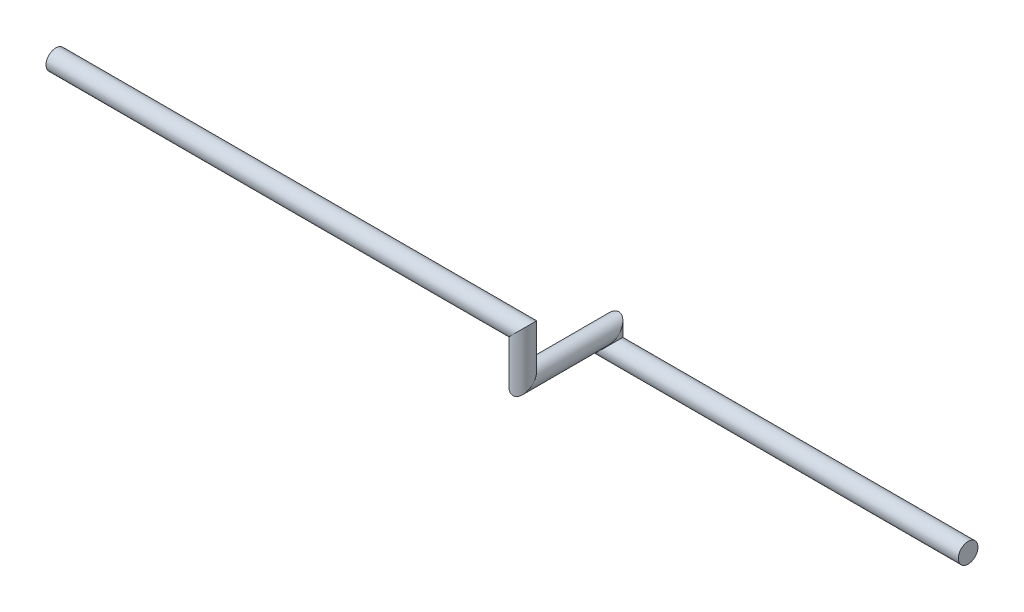
ISO-10303-21;
HEADER;
FILE_DESCRIPTION(('STEP AP214'),'2;1');
FILE_NAME('part.step','',(''),(''),'','','');
FILE_SCHEMA(('AUTOMOTIVE_DESIGN { 1 0 10303 214 1 1 1 1 }'));
ENDSEC;
DATA;
#1=APPLICATION_CONTEXT('core data for automotive mechanical design processes');
#2=APPLICATION_PROTOCOL_DEFINITION('international standard','automotive_design',2000,#1);
#3=PRODUCT_CONTEXT('',#1,'mechanical');
#4=PRODUCT('Part','Part','',(#3));
#5=PRODUCT_RELATED_PRODUCT_CATEGORY('part','',(#4));
#6=PRODUCT_DEFINITION_FORMATION('','',#4);
#7=PRODUCT_DEFINITION_CONTEXT('part definition',#1,'design');
#8=PRODUCT_DEFINITION('design','',#6,#7);
#9=PRODUCT_DEFINITION_SHAPE('','',#8);
#10=(LENGTH_UNIT() NAMED_UNIT(*) SI_UNIT(.MILLI.,.METRE.));
#11=(NAMED_UNIT(*) PLANE_ANGLE_UNIT() SI_UNIT($,.RADIAN.));
#12=(NAMED_UNIT(*) SI_UNIT($,.STERADIAN.) SOLID_ANGLE_UNIT());
#13=UNCERTAINTY_MEASURE_WITH_UNIT(LENGTH_MEASURE(1.E-05),#10,'distance_accuracy_value','');
#14=(GEOMETRIC_REPRESENTATION_CONTEXT(3) GLOBAL_UNCERTAINTY_ASSIGNED_CONTEXT((#13)) GLOBAL_UNIT_ASSIGNED_CONTEXT((#10,
#11,#12)) REPRESENTATION_CONTEXT('',''));
#15=CARTESIAN_POINT('',(0.,0.,0.));
#16=DIRECTION('',(0.,0.,1.));
#17=DIRECTION('',(1.,0.,0.));
#18=AXIS2_PLACEMENT_3D('',#15,#16,#17);
#19=CARTESIAN_POINT('',(-1150.,80.,120.));
#20=DIRECTION('',(1.,0.,0.));
#21=DIRECTION('',(0.,0.,-1.));
#22=AXIS2_PLACEMENT_3D('',#19,#20,#21);
#23=PLANE('',#22);
#24=CARTESIAN_POINT('',(-1150.,80.,120.));
#25=DIRECTION('',(1.,0.,0.));
#26=DIRECTION('',(0.,0.,-1.));
#27=AXIS2_PLACEMENT_3D('',#24,#25,#26);
#28=CIRCLE('',#27,13.7);
#29=CARTESIAN_POINT('',(-1150.,80.,106.3));
#30=VERTEX_POINT('',#29);
#31=EDGE_CURVE('E38',#30,#30,#28,.T.);
#32=ORIENTED_EDGE('',*,*,#31,.F.);
#33=EDGE_LOOP('',(#32));
#34=FACE_BOUND('',#33,.T.);
#35=ADVANCED_FACE('F35',(#34),#23,.F.);
#36=CARTESIAN_POINT('',(0.,0.,0.));
#37=DIRECTION('',(1.,0.,0.));
#38=DIRECTION('',(0.,0.,-1.));
#39=AXIS2_PLACEMENT_3D('',#36,#37,#38);
#40=PLANE('',#39);
#41=CARTESIAN_POINT('',(0.,0.,0.));
#42=DIRECTION('',(1.,0.,0.));
#43=DIRECTION('',(0.,0.,-1.));
#44=AXIS2_PLACEMENT_3D('',#41,#42,#43);
#45=CIRCLE('',#44,13.7);
#46=CARTESIAN_POINT('',(0.,0.,-13.7));
#47=VERTEX_POINT('',#46);
#48=EDGE_CURVE('E43',#47,#47,#45,.T.);
#49=ORIENTED_EDGE('',*,*,#48,.T.);
#50=EDGE_LOOP('',(#49));
#51=FACE_BOUND('',#50,.T.);
#52=ADVANCED_FACE('F86',(#51),#40,.T.);
#53=CARTESIAN_POINT('',(-469.76,80.,120.));
#54=DIRECTION('',(-1.,0.,0.));
#55=DIRECTION('',(0.,0.,1.));
#56=AXIS2_PLACEMENT_3D('',#53,#54,#55);
#57=CYLINDRICAL_SURFACE('',#56,13.7);
#58=CARTESIAN_POINT('',(-500.,80.,120.));
#59=DIRECTION('',(-0.707106781186548,0.707106781186548,0.));
#60=DIRECTION('',(0.707106781186548,0.707106781186548,0.));
#61=AXIS2_PLACEMENT_3D('',#58,#59,#60);
#62=ELLIPSE('',#61,19.3747258045114,13.7);
#63=CARTESIAN_POINT('',(-486.3,93.7,120.));
#64=VERTEX_POINT('',#63);
#65=EDGE_CURVE('E53',#64,#64,#62,.T.);
#66=ORIENTED_EDGE('',*,*,#65,.T.);
#67=EDGE_LOOP('',(#66));
#68=FACE_BOUND('',#67,.T.);
#69=ORIENTED_EDGE('',*,*,#31,.T.);
#70=EDGE_LOOP('',(#69));
#71=FACE_BOUND('',#70,.T.);
#72=ADVANCED_FACE('F83',(#68,#71),#57,.T.);
#73=CARTESIAN_POINT('',(-500.,4.83000000000001,120.));
#74=DIRECTION('',(0.,1.,0.));
#75=DIRECTION('',(0.,0.,1.));
#76=AXIS2_PLACEMENT_3D('',#73,#74,#75);
#77=CYLINDRICAL_SURFACE('',#76,13.7);
#78=CARTESIAN_POINT('',(-500.,20.,120.));
#79=DIRECTION('',(0.,0.707106781186547,0.707106781186547));
#80=DIRECTION('',(0.,-0.707106781186548,0.707106781186548));
#81=AXIS2_PLACEMENT_3D('',#78,#79,#80);
#82=ELLIPSE('',#81,19.3747258045114,13.7);
#83=CARTESIAN_POINT('',(-500.,6.29999999999999,133.7));
#84=VERTEX_POINT('',#83);
#85=EDGE_CURVE('E76',#84,#84,#82,.T.);
#86=ORIENTED_EDGE('',*,*,#85,.T.);
#87=EDGE_LOOP('',(#86));
#88=FACE_BOUND('',#87,.T.);
#89=ORIENTED_EDGE('',*,*,#65,.F.);
#90=EDGE_LOOP('',(#89));
#91=FACE_BOUND('',#90,.T.);
#92=ADVANCED_FACE('F85',(#88,#91),#77,.T.);
#93=CARTESIAN_POINT('',(-500.,20.,-15.17));
#94=DIRECTION('',(0.,0.,1.));
#95=DIRECTION('',(1.,0.,0.));
#96=AXIS2_PLACEMENT_3D('',#93,#94,#95);
#97=CYLINDRICAL_SURFACE('',#96,13.7);
#98=CARTESIAN_POINT('',(-500.,20.,0.));
#99=DIRECTION('',(0.,0.707106781186547,0.707106781186547));
#100=DIRECTION('',(0.,0.707106781186548,-0.707106781186548));
#101=AXIS2_PLACEMENT_3D('',#98,#99,#100);
#102=ELLIPSE('',#101,19.3747258045114,13.7);
#103=CARTESIAN_POINT('',(-500.,33.7,-13.7));
#104=VERTEX_POINT('',#103);
#105=EDGE_CURVE('E74',#104,#104,#102,.T.);
#106=ORIENTED_EDGE('',*,*,#105,.T.);
#107=EDGE_LOOP('',(#106));
#108=FACE_BOUND('',#107,.T.);
#109=ORIENTED_EDGE('',*,*,#85,.F.);
#110=EDGE_LOOP('',(#109));
#111=FACE_BOUND('',#110,.T.);
#112=ADVANCED_FACE('F71',(#108,#111),#97,.T.);
#113=CARTESIAN_POINT('',(-500.,-30.24,0.));
#114=DIRECTION('',(0.,1.,0.));
#115=DIRECTION('',(0.,0.,1.));
#116=AXIS2_PLACEMENT_3D('',#113,#114,#115);
#117=CYLINDRICAL_SURFACE('',#116,13.7);
#118=CARTESIAN_POINT('',(-500.,0.,0.));
#119=DIRECTION('',(-0.707106781186547,0.707106781186547,0.));
#120=DIRECTION('',(-0.707106781186548,-0.707106781186548,0.));
#121=AXIS2_PLACEMENT_3D('',#118,#119,#120);
#122=ELLIPSE('',#121,19.3747258045114,13.7);
#123=CARTESIAN_POINT('',(-513.7,-13.7,0.));
#124=VERTEX_POINT('',#123);
#125=EDGE_CURVE('E11',#124,#124,#122,.T.);
#126=ORIENTED_EDGE('',*,*,#125,.T.);
#127=EDGE_LOOP('',(#126));
#128=FACE_BOUND('',#127,.T.);
#129=ORIENTED_EDGE('',*,*,#105,.F.);
#130=EDGE_LOOP('',(#129));
#131=FACE_BOUND('',#130,.T.);
#132=ADVANCED_FACE('F68',(#128,#131),#117,.T.);
#133=CARTESIAN_POINT('',(0.,0.,0.));
#134=DIRECTION('',(-1.,0.,0.));
#135=DIRECTION('',(0.,0.,1.));
#136=AXIS2_PLACEMENT_3D('',#133,#134,#135);
#137=CYLINDRICAL_SURFACE('',#136,13.7);
#138=ORIENTED_EDGE('',*,*,#48,.F.);
#139=EDGE_LOOP('',(#138));
#140=FACE_BOUND('',#139,.T.);
#141=ORIENTED_EDGE('',*,*,#125,.F.);
#142=EDGE_LOOP('',(#141));
#143=FACE_BOUND('',#142,.T.);
#144=ADVANCED_FACE('F66',(#140,#143),#137,.T.);
#145=CLOSED_SHELL('',(#35,#52,#72,#92,#112,#132,#144));
#146=MANIFOLD_SOLID_BREP('B2',#145);
#147=ADVANCED_BREP_SHAPE_REPRESENTATION('',(#18,#146),#14);
#148=SHAPE_DEFINITION_REPRESENTATION(#9,#147);
ENDSEC;
END-ISO-10303-21;
